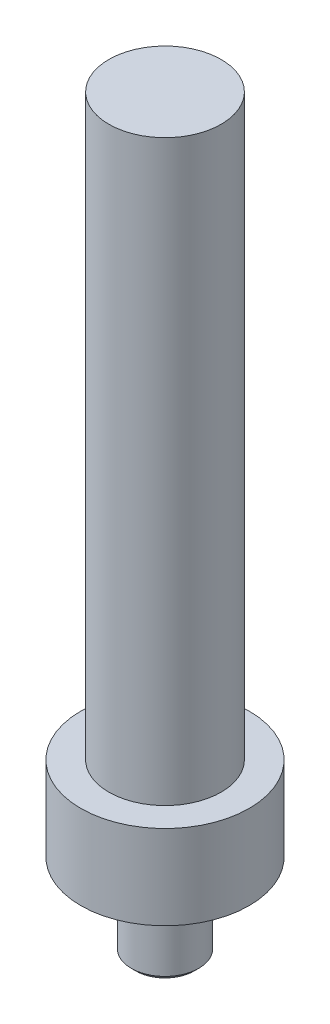
ISO-10303-21;
HEADER;
FILE_DESCRIPTION(('STEP AP214'),'2;1');
FILE_NAME('part.step','',(''),(''),'','','');
FILE_SCHEMA(('AUTOMOTIVE_DESIGN { 1 0 10303 214 1 1 1 1 }'));
ENDSEC;
DATA;
#1=APPLICATION_CONTEXT('core data for automotive mechanical design processes');
#2=APPLICATION_PROTOCOL_DEFINITION('international standard','automotive_design',2000,#1);
#3=PRODUCT_CONTEXT('',#1,'mechanical');
#4=PRODUCT('Part','Part','',(#3));
#5=PRODUCT_RELATED_PRODUCT_CATEGORY('part','',(#4));
#6=PRODUCT_DEFINITION_FORMATION('','',#4);
#7=PRODUCT_DEFINITION_CONTEXT('part definition',#1,'design');
#8=PRODUCT_DEFINITION('design','',#6,#7);
#9=PRODUCT_DEFINITION_SHAPE('','',#8);
#10=(LENGTH_UNIT() NAMED_UNIT(*) SI_UNIT(.MILLI.,.METRE.));
#11=(NAMED_UNIT(*) PLANE_ANGLE_UNIT() SI_UNIT($,.RADIAN.));
#12=(NAMED_UNIT(*) SI_UNIT($,.STERADIAN.) SOLID_ANGLE_UNIT());
#13=UNCERTAINTY_MEASURE_WITH_UNIT(LENGTH_MEASURE(1.E-05),#10,'distance_accuracy_value','');
#14=(GEOMETRIC_REPRESENTATION_CONTEXT(3) GLOBAL_UNCERTAINTY_ASSIGNED_CONTEXT((#13)) GLOBAL_UNIT_ASSIGNED_CONTEXT((#10,
#11,#12)) REPRESENTATION_CONTEXT('',''));
#15=CARTESIAN_POINT('',(0.,0.,0.));
#16=DIRECTION('',(0.,0.,1.));
#17=DIRECTION('',(1.,0.,0.));
#18=AXIS2_PLACEMENT_3D('',#15,#16,#17);
#19=CARTESIAN_POINT('',(0.,15.,0.));
#20=DIRECTION('',(0.,-1.,0.));
#21=DIRECTION('',(0.,0.,-1.));
#22=AXIS2_PLACEMENT_3D('',#19,#20,#21);
#23=CYLINDRICAL_SURFACE('',#22,15.);
#24=CARTESIAN_POINT('',(0.,15.,0.));
#25=DIRECTION('',(0.,1.,0.));
#26=DIRECTION('',(0.,0.,1.));
#27=AXIS2_PLACEMENT_3D('',#24,#25,#26);
#28=CIRCLE('',#27,15.);
#29=CARTESIAN_POINT('',(0.,15.,15.));
#30=VERTEX_POINT('',#29);
#31=EDGE_CURVE('E43',#30,#30,#28,.T.);
#32=ORIENTED_EDGE('',*,*,#31,.F.);
#33=EDGE_LOOP('',(#32));
#34=FACE_BOUND('',#33,.T.);
#35=CARTESIAN_POINT('',(0.,0.,0.));
#36=DIRECTION('',(0.,1.,0.));
#37=DIRECTION('',(0.,0.,1.));
#38=AXIS2_PLACEMENT_3D('',#35,#36,#37);
#39=CIRCLE('',#38,15.);
#40=CARTESIAN_POINT('',(0.,0.,15.));
#41=VERTEX_POINT('',#40);
#42=EDGE_CURVE('E39',#41,#41,#39,.T.);
#43=ORIENTED_EDGE('',*,*,#42,.T.);
#44=EDGE_LOOP('',(#43));
#45=FACE_BOUND('',#44,.T.);
#46=ADVANCED_FACE('F36',(#34,#45),#23,.T.);
#47=CARTESIAN_POINT('',(0.,15.,0.));
#48=DIRECTION('',(0.,1.,0.));
#49=DIRECTION('',(0.,0.,1.));
#50=AXIS2_PLACEMENT_3D('',#47,#48,#49);
#51=PLANE('',#50);
#52=CARTESIAN_POINT('',(0.,15.,0.));
#53=DIRECTION('',(0.,1.,0.));
#54=DIRECTION('',(0.,0.,1.));
#55=AXIS2_PLACEMENT_3D('',#52,#53,#54);
#56=CIRCLE('',#55,10.);
#57=CARTESIAN_POINT('',(0.,15.,10.));
#58=VERTEX_POINT('',#57);
#59=EDGE_CURVE('E10',#58,#58,#56,.T.);
#60=ORIENTED_EDGE('',*,*,#59,.F.);
#61=EDGE_LOOP('',(#60));
#62=FACE_BOUND('',#61,.T.);
#63=ORIENTED_EDGE('',*,*,#31,.T.);
#64=EDGE_LOOP('',(#63));
#65=FACE_BOUND('',#64,.T.);
#66=ADVANCED_FACE('F78',(#62,#65),#51,.T.);
#67=CARTESIAN_POINT('',(0.,0.,0.));
#68=DIRECTION('',(0.,1.,0.));
#69=DIRECTION('',(0.,0.,1.));
#70=AXIS2_PLACEMENT_3D('',#67,#68,#69);
#71=PLANE('',#70);
#72=ORIENTED_EDGE('',*,*,#42,.F.);
#73=EDGE_LOOP('',(#72));
#74=FACE_BOUND('',#73,.T.);
#75=CARTESIAN_POINT('',(0.,0.,0.));
#76=DIRECTION('',(0.,1.,0.));
#77=DIRECTION('',(0.,0.,1.));
#78=AXIS2_PLACEMENT_3D('',#75,#76,#77);
#79=CIRCLE('',#78,6.);
#80=CARTESIAN_POINT('',(0.,0.,6.));
#81=VERTEX_POINT('',#80);
#82=EDGE_CURVE('E52',#81,#81,#79,.T.);
#83=ORIENTED_EDGE('',*,*,#82,.T.);
#84=EDGE_LOOP('',(#83));
#85=FACE_BOUND('',#84,.T.);
#86=ADVANCED_FACE('F83',(#74,#85),#71,.F.);
#87=CARTESIAN_POINT('',(0.,118.,0.));
#88=DIRECTION('',(0.,-1.,0.));
#89=DIRECTION('',(0.,0.,-1.));
#90=AXIS2_PLACEMENT_3D('',#87,#88,#89);
#91=CYLINDRICAL_SURFACE('',#90,10.);
#92=CARTESIAN_POINT('',(0.,118.,0.));
#93=DIRECTION('',(0.,1.,0.));
#94=DIRECTION('',(0.,0.,1.));
#95=AXIS2_PLACEMENT_3D('',#92,#93,#94);
#96=CIRCLE('',#95,10.);
#97=CARTESIAN_POINT('',(0.,118.,10.));
#98=VERTEX_POINT('',#97);
#99=EDGE_CURVE('E49',#98,#98,#96,.T.);
#100=ORIENTED_EDGE('',*,*,#99,.F.);
#101=EDGE_LOOP('',(#100));
#102=FACE_BOUND('',#101,.T.);
#103=ORIENTED_EDGE('',*,*,#59,.T.);
#104=EDGE_LOOP('',(#103));
#105=FACE_BOUND('',#104,.T.);
#106=ADVANCED_FACE('F93',(#102,#105),#91,.T.);
#107=CARTESIAN_POINT('',(0.,118.,0.));
#108=DIRECTION('',(0.,1.,0.));
#109=DIRECTION('',(0.,0.,1.));
#110=AXIS2_PLACEMENT_3D('',#107,#108,#109);
#111=PLANE('',#110);
#112=ORIENTED_EDGE('',*,*,#99,.T.);
#113=EDGE_LOOP('',(#112));
#114=FACE_BOUND('',#113,.T.);
#115=ADVANCED_FACE('F97',(#114),#111,.T.);
#116=CARTESIAN_POINT('',(0.,-15.,0.));
#117=DIRECTION('',(0.,1.,0.));
#118=DIRECTION('',(0.,0.,1.));
#119=AXIS2_PLACEMENT_3D('',#116,#117,#118);
#120=CYLINDRICAL_SURFACE('',#119,6.);
#121=ORIENTED_EDGE('',*,*,#82,.F.);
#122=EDGE_LOOP('',(#121));
#123=FACE_BOUND('',#122,.T.);
#124=CARTESIAN_POINT('',(0.,-14.172,0.));
#125=DIRECTION('',(0.,1.,0.));
#126=DIRECTION('',(0.,0.,1.));
#127=AXIS2_PLACEMENT_3D('',#124,#125,#126);
#128=CIRCLE('',#127,6.);
#129=CARTESIAN_POINT('',(0.,-14.172,6.));
#130=VERTEX_POINT('',#129);
#131=EDGE_CURVE('E58',#130,#130,#128,.T.);
#132=ORIENTED_EDGE('',*,*,#131,.T.);
#133=EDGE_LOOP('',(#132));
#134=FACE_BOUND('',#133,.T.);
#135=ADVANCED_FACE('F62',(#123,#134),#120,.T.);
#136=CARTESIAN_POINT('',(0.,-15.,0.));
#137=DIRECTION('',(0.,1.,0.));
#138=DIRECTION('',(0.,0.,1.));
#139=AXIS2_PLACEMENT_3D('',#136,#137,#138);
#140=CONICAL_SURFACE('',#139,5.172,0.785398163397449);
#141=ORIENTED_EDGE('',*,*,#131,.F.);
#142=EDGE_LOOP('',(#141));
#143=FACE_BOUND('',#142,.T.);
#144=CARTESIAN_POINT('',(0.,-15.,0.));
#145=DIRECTION('',(0.,1.,0.));
#146=DIRECTION('',(0.,0.,1.));
#147=AXIS2_PLACEMENT_3D('',#144,#145,#146);
#148=CIRCLE('',#147,5.172);
#149=CARTESIAN_POINT('',(0.,-15.,5.172));
#150=VERTEX_POINT('',#149);
#151=EDGE_CURVE('E55',#150,#150,#148,.T.);
#152=ORIENTED_EDGE('',*,*,#151,.T.);
#153=EDGE_LOOP('',(#152));
#154=FACE_BOUND('',#153,.T.);
#155=ADVANCED_FACE('F64',(#143,#154),#140,.T.);
#156=CARTESIAN_POINT('',(0.,-15.,0.));
#157=DIRECTION('',(0.,-1.,0.));
#158=DIRECTION('',(0.,0.,-1.));
#159=AXIS2_PLACEMENT_3D('',#156,#157,#158);
#160=PLANE('',#159);
#161=ORIENTED_EDGE('',*,*,#151,.F.);
#162=EDGE_LOOP('',(#161));
#163=FACE_BOUND('',#162,.T.);
#164=ADVANCED_FACE('F67',(#163),#160,.T.);
#165=CLOSED_SHELL('',(#46,#66,#86,#106,#115,#135,#155,#164));
#166=MANIFOLD_SOLID_BREP('B2',#165);
#167=ADVANCED_BREP_SHAPE_REPRESENTATION('',(#18,#166),#14);
#168=SHAPE_DEFINITION_REPRESENTATION(#9,#167);
ENDSEC;
END-ISO-10303-21;
